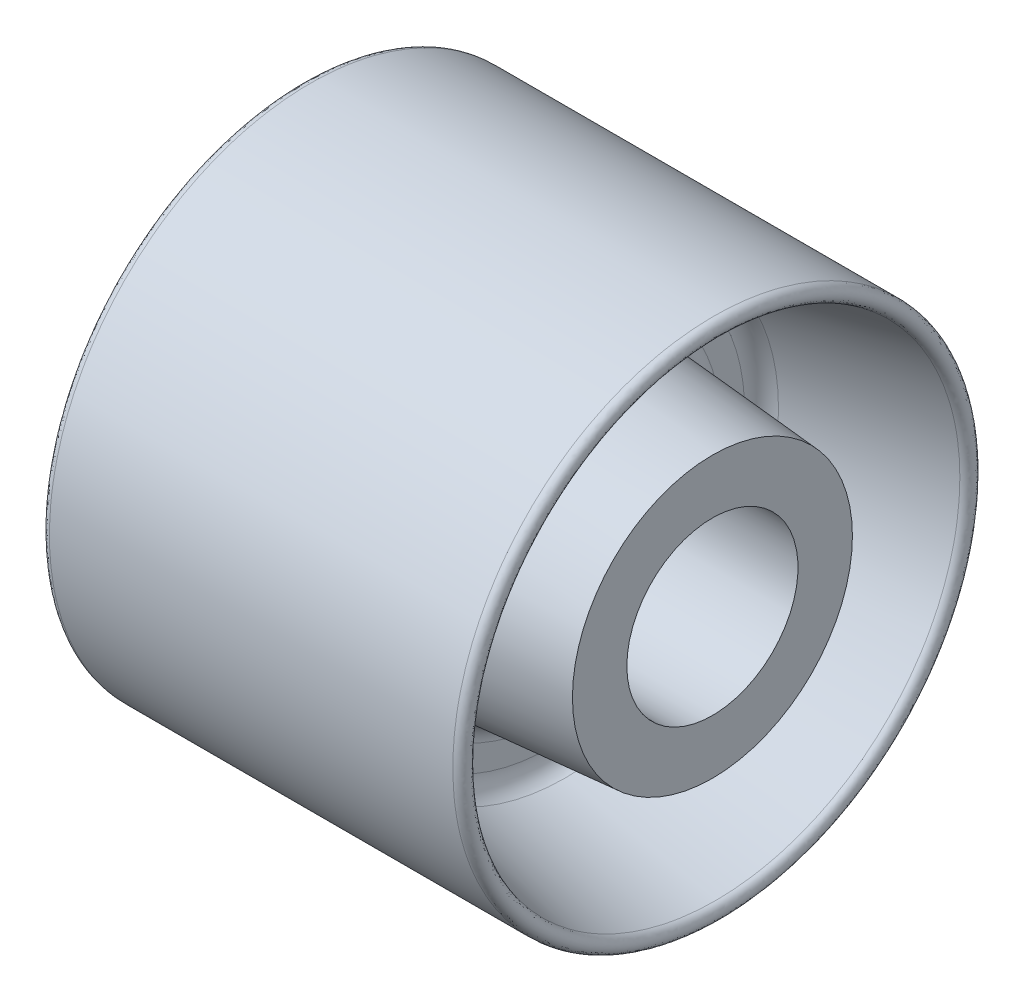
ISO-10303-21;
HEADER;
FILE_DESCRIPTION(('STEP AP214'),'2;1');
FILE_NAME('part.step','',(''),(''),'','','');
FILE_SCHEMA(('AUTOMOTIVE_DESIGN { 1 0 10303 214 1 1 1 1 }'));
ENDSEC;
DATA;
#1=APPLICATION_CONTEXT('core data for automotive mechanical design processes');
#2=APPLICATION_PROTOCOL_DEFINITION('international standard','automotive_design',2000,#1);
#3=PRODUCT_CONTEXT('',#1,'mechanical');
#4=PRODUCT('Part','Part','',(#3));
#5=PRODUCT_RELATED_PRODUCT_CATEGORY('part','',(#4));
#6=PRODUCT_DEFINITION_FORMATION('','',#4);
#7=PRODUCT_DEFINITION_CONTEXT('part definition',#1,'design');
#8=PRODUCT_DEFINITION('design','',#6,#7);
#9=PRODUCT_DEFINITION_SHAPE('','',#8);
#10=(LENGTH_UNIT() NAMED_UNIT(*) SI_UNIT(.MILLI.,.METRE.));
#11=(NAMED_UNIT(*) PLANE_ANGLE_UNIT() SI_UNIT($,.RADIAN.));
#12=(NAMED_UNIT(*) SI_UNIT($,.STERADIAN.) SOLID_ANGLE_UNIT());
#13=UNCERTAINTY_MEASURE_WITH_UNIT(LENGTH_MEASURE(1.E-05),#10,'distance_accuracy_value','');
#14=(GEOMETRIC_REPRESENTATION_CONTEXT(3) GLOBAL_UNCERTAINTY_ASSIGNED_CONTEXT((#13)) GLOBAL_UNIT_ASSIGNED_CONTEXT((#10,
#11,#12)) REPRESENTATION_CONTEXT('',''));
#15=CARTESIAN_POINT('',(0.,0.,0.));
#16=DIRECTION('',(0.,0.,1.));
#17=DIRECTION('',(1.,0.,0.));
#18=AXIS2_PLACEMENT_3D('',#15,#16,#17);
#19=CARTESIAN_POINT('',(31.6980645324234,-2.21631317579351E-12,-41.));
#20=CARTESIAN_POINT('',(31.6980645324234,-5.36688731821035,-40.9999999999997));
#21=CARTESIAN_POINT('',(31.6980645323489,-10.7316633803912,-39.9328796930077));
#22=CARTESIAN_POINT('',(31.6980645324979,-20.6483780735503,-35.8252419729161));
#23=CARTESIAN_POINT('',(31.6980645324234,-25.1964156120478,-32.7863404452495));
#24=CARTESIAN_POINT('',(31.6980645324234,-32.7863404452522,-25.1964156120443));
#25=CARTESIAN_POINT('',(31.6980645324234,-35.8252419728991,-20.6483780735927));
#26=CARTESIAN_POINT('',(31.6980645324234,-39.9328796930281,-10.7316633803406));
#27=CARTESIAN_POINT('',(31.6980645324234,-41.0000000000003,-5.3668873182443));
#28=CARTESIAN_POINT('',(31.6980645324234,-40.9999999999997,5.36688731824873));
#29=CARTESIAN_POINT('',(31.6980645324234,-39.9328796930269,10.7316633803449));
#30=CARTESIAN_POINT('',(31.6980645324234,-35.8252419728969,20.6483780735966));
#31=CARTESIAN_POINT('',(31.6980645324234,-32.7863404452448,25.1964156120525));
#32=CARTESIAN_POINT('',(31.6980645324234,-25.1964156120489,32.7863404452475));
#33=CARTESIAN_POINT('',(31.6980645323489,-20.6483780735927,35.8252419728991));
#34=CARTESIAN_POINT('',(31.6980645324979,-10.7316633803406,39.9328796930281));
#35=CARTESIAN_POINT('',(31.6980645324234,-5.36688731823902,41.0000000000003));
#36=CARTESIAN_POINT('',(31.6980645324234,5.36688731824348,40.9999999999997));
#37=CARTESIAN_POINT('',(31.6980645324234,10.7316633803529,39.9328796930236));
#38=CARTESIAN_POINT('',(31.6980645324234,20.6483780735886,35.8252419729002));
#39=CARTESIAN_POINT('',(31.6980645324234,25.1964156120758,32.7863404452215));
#40=CARTESIAN_POINT('',(31.6980645324234,32.7863404452243,25.1964156120722));
#41=CARTESIAN_POINT('',(31.6980645324234,35.8252419728991,20.6483780735927));
#42=CARTESIAN_POINT('',(31.6980645324234,39.9328796930281,10.7316633803406));
#43=CARTESIAN_POINT('',(31.6980645324234,41.0000000000003,5.36688731824428));
#44=CARTESIAN_POINT('',(31.6980645324234,40.9999999999997,-5.36688731824874));
#45=CARTESIAN_POINT('',(31.6980645324234,39.9328796930236,-10.7316633803528));
#46=CARTESIAN_POINT('',(31.6980645324234,35.8252419729002,-20.6483780735886));
#47=CARTESIAN_POINT('',(31.6980645324234,32.7863404452309,-25.1964156120664));
#48=CARTESIAN_POINT('',(31.6980645324234,25.1964156120629,-32.7863404452336));
#49=CARTESIAN_POINT('',(31.6980645324234,20.6483780735464,-35.8252419729183));
#50=CARTESIAN_POINT('',(31.6980645324234,10.7316633803869,-39.9328796930089));
#51=CARTESIAN_POINT('',(31.6980645324234,5.36688731820592,-41.0000000000003));
#52=CARTESIAN_POINT('',(31.6980645324234,-2.21631317579351E-12,-41.));
#53=CARTESIAN_POINT('',(33.8465040906431,-2.21631317579351E-12,-41.));
#54=CARTESIAN_POINT('',(33.8465040906431,-5.36688731821077,-41.));
#55=CARTESIAN_POINT('',(33.8465040907176,-10.7316633804372,-39.9328796931181));
#56=CARTESIAN_POINT('',(33.8465040905686,-20.6483780735043,-35.8252419728058));
#57=CARTESIAN_POINT('',(33.8465040906245,-25.196415612057,-32.7863404452493));
#58=CARTESIAN_POINT('',(33.8465040906617,-32.7863404452431,-25.1964156120445));
#59=CARTESIAN_POINT('',(33.8465040906617,-35.8252419729006,-20.6483780735933));
#60=CARTESIAN_POINT('',(33.8465040906245,-39.9328796930267,-10.73166338034));
#61=CARTESIAN_POINT('',(33.8465040906617,-41.,-5.36688731824472));
#62=CARTESIAN_POINT('',(33.8465040906245,-41.,5.36688731824914));
#63=CARTESIAN_POINT('',(33.8465040906245,-39.932879693025,10.7316633803441));
#64=CARTESIAN_POINT('',(33.8465040906617,-35.8252419728989,20.6483780735974));
#65=CARTESIAN_POINT('',(33.8465040906431,-32.7863404452586,25.196415612057));
#66=CARTESIAN_POINT('',(33.8465040906431,-25.1964156120352,32.7863404452431));
#67=CARTESIAN_POINT('',(33.8465040907176,-20.6483780736399,35.8252419730123));
#68=CARTESIAN_POINT('',(33.8465040905686,-10.7316633802935,39.932879692915));
#69=CARTESIAN_POINT('',(33.8465040906431,-5.36688731823944,41.));
#70=CARTESIAN_POINT('',(33.8465040906431,5.3668873182439,41.));
#71=CARTESIAN_POINT('',(33.8465040906059,10.7316633803534,39.932879693025));
#72=CARTESIAN_POINT('',(33.8465040906804,20.6483780735881,35.8252419728989));
#73=CARTESIAN_POINT('',(33.8465040906245,25.1964156120849,32.7863404452121));
#74=CARTESIAN_POINT('',(33.8465040906617,32.7863404452152,25.1964156120818));
#75=CARTESIAN_POINT('',(33.8465040906617,35.8252419729006,20.6483780735933));
#76=CARTESIAN_POINT('',(33.8465040906245,39.9328796930267,10.73166338034));
#77=CARTESIAN_POINT('',(33.8465040906431,41.,5.3668873182447));
#78=CARTESIAN_POINT('',(33.8465040906431,41.,-5.36688731824916));
#79=CARTESIAN_POINT('',(33.8465040906245,39.932879693025,-10.7316633803534));
#80=CARTESIAN_POINT('',(33.8465040906617,35.8252419728989,-20.6483780735881));
#81=CARTESIAN_POINT('',(33.8465040906431,32.78634044524,-25.1964156120663));
#82=CARTESIAN_POINT('',(33.8465040906431,25.1964156120538,-32.7863404452338));
#83=CARTESIAN_POINT('',(33.8465040906804,20.6483780735467,-35.8252419729192));
#84=CARTESIAN_POINT('',(33.8465040906059,10.7316633803865,-39.9328796930081));
#85=CARTESIAN_POINT('',(33.8465040906431,5.36688731820634,-41.));
#86=CARTESIAN_POINT('',(33.8465040906431,-2.21631317579351E-12,-41.));
#87=CARTESIAN_POINT('',(34.0673246299096,-2.11317966753846E-12,-38.86293874099));
#88=CARTESIAN_POINT('',(34.0673246299096,-5.08360752716832,-38.86293874099));
#89=CARTESIAN_POINT('',(34.0673246300399,-10.1755618435465,-37.8500860532935));
#90=CARTESIAN_POINT('',(34.0673246297792,-19.56884373485,-33.9592612987861));
#91=CARTESIAN_POINT('',(34.0673246298909,-23.8855941652727,-31.0749008759753));
#92=CARTESIAN_POINT('',(34.0673246299282,-31.0749008759131,-23.8855941652046));
#93=CARTESIAN_POINT('',(34.0673246299282,-33.9592612987133,-19.5688437348647));
#94=CARTESIAN_POINT('',(34.0673246298909,-37.8500860533696,-10.175561843524));
#95=CARTESIAN_POINT('',(34.0673246299096,-38.86293874099,-5.08360752716858));
#96=CARTESIAN_POINT('',(34.0673246299096,-38.86293874099,5.08360752717281));
#97=CARTESIAN_POINT('',(34.0673246298909,-37.850086053368,10.1755618435325));
#98=CARTESIAN_POINT('',(34.0673246299282,-33.9592612987116,19.568843734864));
#99=CARTESIAN_POINT('',(34.0673246299096,-31.0749008759567,23.8855941652541));
#100=CARTESIAN_POINT('',(34.0673246299096,-23.8855941652232,31.0749008759317));
#101=CARTESIAN_POINT('',(34.0673246300399,-19.5688437348554,33.9592612987133));
#102=CARTESIAN_POINT('',(34.0673246297792,-10.1755618435333,37.8500860533696));
#103=CARTESIAN_POINT('',(34.0673246299095,-5.08360752716436,38.86293874099));
#104=CARTESIAN_POINT('',(34.0673246299095,5.08360752716859,38.86293874099));
#105=CARTESIAN_POINT('',(34.0673246298909,10.1755618435512,37.850086053368));
#106=CARTESIAN_POINT('',(34.0673246299282,19.5688437348453,33.9592612987117));
#107=CARTESIAN_POINT('',(34.0673246299095,23.8855941653007,31.0749008759195));
#108=CARTESIAN_POINT('',(34.0673246299095,31.0749008758852,23.8855941652604));
#109=CARTESIAN_POINT('',(34.0673246299282,33.9592612987319,19.5688437348647));
#110=CARTESIAN_POINT('',(34.0673246298909,37.850086053351,10.175561843524));
#111=CARTESIAN_POINT('',(34.0673246299095,38.86293874099,5.08360752716859));
#112=CARTESIAN_POINT('',(34.0673246299095,38.86293874099,-5.08360752717281));
#113=CARTESIAN_POINT('',(34.0673246299095,37.8500860533494,-10.1755618435139));
#114=CARTESIAN_POINT('',(34.0673246299095,33.9592612987303,-19.5688437348825));
#115=CARTESIAN_POINT('',(34.0673246299096,31.0749008759381,-23.8855941652541));
#116=CARTESIAN_POINT('',(34.0673246299096,23.8855941652418,-31.0749008759317));
#117=CARTESIAN_POINT('',(34.0673246299095,19.5688437348368,-33.9592612987319));
#118=CARTESIAN_POINT('',(34.0673246299095,10.1755618435519,-37.850086053351));
#119=CARTESIAN_POINT('',(34.0673246299096,5.08360752716409,-38.86293874099));
#120=CARTESIAN_POINT('',(34.0673246299096,-2.11317966753846E-12,-38.86293874099));
#121=CARTESIAN_POINT('',(31.9642777478536,-2.09116081309969E-12,-38.4236366271796));
#122=CARTESIAN_POINT('',(31.9642777478537,-5.02537549919789,-38.4236366271793));
#123=CARTESIAN_POINT('',(31.9642777478176,-10.0612475815541,-37.4219393894472));
#124=CARTESIAN_POINT('',(31.9642777478897,-19.3469307153259,-33.5756834995556));
#125=CARTESIAN_POINT('',(31.9642777478714,-23.6161369234429,-30.7230911104158));
#126=CARTESIAN_POINT('',(31.9642777478359,-30.7230911104131,-23.6161369234343));
#127=CARTESIAN_POINT('',(31.9642777478334,-33.5756834995408,-19.3469307153323));
#128=CARTESIAN_POINT('',(31.9642777478739,-37.4219393894652,-10.06124758154));
#129=CARTESIAN_POINT('',(31.9642777478536,-38.4236366271798,-5.02537549918906));
#130=CARTESIAN_POINT('',(31.9642777478537,-38.4236366271793,5.02537549919324));
#131=CARTESIAN_POINT('',(31.9642777478742,-37.4219393894625,10.0612475815481));
#132=CARTESIAN_POINT('',(31.9642777478331,-33.5756834995403,19.3469307153319));
#133=CARTESIAN_POINT('',(31.9642777478701,-30.7230911104109,23.6161369234473));
#134=CARTESIAN_POINT('',(31.9642777478372,-23.6161369234391,30.7230911104086));
#135=CARTESIAN_POINT('',(31.9642777478152,-19.3469307153268,33.5756834995389));
#136=CARTESIAN_POINT('',(31.9642777478921,-10.0612475815455,37.4219393894671));
#137=CARTESIAN_POINT('',(31.9642777478536,-5.02537549918906,38.4236366271798));
#138=CARTESIAN_POINT('',(31.9642777478537,5.02537549919324,38.4236366271793));
#139=CARTESIAN_POINT('',(31.9642777478889,10.0612475815598,37.421939389461));
#140=CARTESIAN_POINT('',(31.9642777478184,19.3469307153202,33.5756834995418));
#141=CARTESIAN_POINT('',(31.9642777478714,23.6161369234801,30.7230911103785));
#142=CARTESIAN_POINT('',(31.9642777478359,30.7230911103758,23.6161369234715));
#143=CARTESIAN_POINT('',(31.9642777478368,33.5756834995442,19.3469307153259));
#144=CARTESIAN_POINT('',(31.9642777478705,37.4219393894618,10.0612475815463));
#145=CARTESIAN_POINT('',(31.9642777478536,38.4236366271798,5.02537549918907));
#146=CARTESIAN_POINT('',(31.9642777478537,38.4236366271793,-5.02537549919323));
#147=CARTESIAN_POINT('',(31.9642777478693,37.4219393894655,-10.0612475815384));
#148=CARTESIAN_POINT('',(31.964277747838,33.5756834995374,-19.3469307153416));
#149=CARTESIAN_POINT('',(31.9642777478688,30.7230911104061,-23.6161369234518));
#150=CARTESIAN_POINT('',(31.9642777478385,23.616136923444,-30.7230911104041));
#151=CARTESIAN_POINT('',(31.9642777478357,19.3469307153139,-33.5756834995489));
#152=CARTESIAN_POINT('',(31.9642777478716,10.0612475815583,-37.4219393894571));
#153=CARTESIAN_POINT('',(31.9642777478536,5.02537549919371,-38.4236366271798));
#154=CARTESIAN_POINT('',(31.9642777478536,-2.09116081309969E-12,-38.4236366271796));
#155=(BOUNDED_SURFACE() B_SPLINE_SURFACE(3,3,((#19,#20,#21,#22,#23,#24,#25,#26,#27,#28,#29,#30,
#31,#32,#33,#34,#35,#36,#37,#38,#39,#40,#41,#42,#43,#44,#45,#46,#47,#48,#49,#50,#51,#52),(#53,
#54,#55,#56,#57,#58,#59,#60,#61,#62,#63,#64,#65,#66,#67,#68,#69,#70,#71,#72,#73,#74,#75,#76,#77,
#78,#79,#80,#81,#82,#83,#84,#85,#86),(#87,#88,#89,#90,#91,#92,#93,#94,#95,#96,#97,#98,#99,#100,
#101,#102,#103,#104,#105,#106,#107,#108,#109,#110,#111,#112,#113,#114,#115,#116,#117,#118,#119,
#120),(#121,#122,#123,#124,#125,#126,#127,#128,#129,#130,#131,#132,#133,#134,#135,#136,#137,
#138,#139,#140,#141,#142,#143,#144,#145,#146,#147,#148,#149,#150,#151,#152,#153,#154)),
.UNSPECIFIED.,.F.,.T.,.F.) B_SPLINE_SURFACE_WITH_KNOTS((4,4),(4,2,2,2,2,2,2,2,2,2,2,2,2,2,2,2,
4),(0.,1.),(0.500000000000009,0.562500000000009,0.625000000000009,0.687500000000009,
0.750000000000009,0.812500000000009,0.875000000000009,0.937500000000009,1.00000000000001,
1.06250000000001,1.12500000000001,1.18750000000001,1.25000000000001,1.31250000000001,
1.37500000000001,1.43750000000001,1.50000000000001),
.UNSPECIFIED.) GEOMETRIC_REPRESENTATION_ITEM() RATIONAL_B_SPLINE_SURFACE(((1.,1.,1.,1.,1.,1.,1.,
1.,1.,1.,1.,1.,1.,1.,1.,1.,1.,1.,1.,1.,1.,1.,1.,1.,1.,1.,1.,1.,1.,1.,1.,1.,1.,1.),
(0.401854550176989,0.401854550176989,0.401854550176991,0.401854550176991,0.401854550176989,
0.401854550176989,0.401854550176991,0.401854550176991,0.401854550176989,0.401854550176989,
0.401854550176989,0.401854550176989,0.40185455017699,0.40185455017699,0.401854550176991,
0.401854550176991,0.401854550176993,0.401854550176993,0.401854550176993,0.401854550176993,
0.401854550176993,0.401854550176993,0.401854550176993,0.401854550176993,0.401854550176993,
0.401854550176993,0.401854550176991,0.401854550176991,0.401854550176991,0.401854550176991,
0.401854550176991,0.401854550176991,0.401854550176989,0.401854550176989),(0.401854550176989,
0.401854550176989,0.401854550176991,0.401854550176991,0.401854550176989,0.401854550176989,
0.401854550176991,0.401854550176991,0.401854550176989,0.401854550176989,0.401854550176989,
0.401854550176989,0.40185455017699,0.40185455017699,0.401854550176991,0.401854550176991,
0.401854550176993,0.401854550176993,0.401854550176993,0.401854550176993,0.401854550176993,
0.401854550176993,0.401854550176993,0.401854550176993,0.401854550176993,0.401854550176993,
0.401854550176991,0.401854550176991,0.401854550176991,0.401854550176991,0.401854550176991,
0.401854550176991,0.401854550176989,0.401854550176989),(1.,1.,1.,1.,1.,1.,1.,1.,1.,1.,1.,1.,1.,
1.,1.,1.,1.,1.,1.,1.,1.,1.,1.,1.,1.,1.,1.,1.,1.,1.,1.,1.,1.,1.))) REPRESENTATION_ITEM('') SURFACE());
#156=CARTESIAN_POINT('',(31.6980645324234,-2.21631317579351E-12,-41.));
#157=CARTESIAN_POINT('',(31.6980645324234,5.36688731820592,-41.0000000000003));
#158=CARTESIAN_POINT('',(31.6980645324234,10.7316633803869,-39.9328796930089));
#159=CARTESIAN_POINT('',(31.6980645324234,20.6483780735464,-35.8252419729183));
#160=CARTESIAN_POINT('',(31.6980645324234,25.1964156120629,-32.7863404452336));
#161=CARTESIAN_POINT('',(31.6980645324234,32.7863404452309,-25.1964156120664));
#162=CARTESIAN_POINT('',(31.6980645324234,35.8252419729002,-20.6483780735886));
#163=CARTESIAN_POINT('',(31.6980645324234,39.9328796930236,-10.7316633803528));
#164=CARTESIAN_POINT('',(31.6980645324234,40.9999999999997,-5.36688731824874));
#165=CARTESIAN_POINT('',(31.6980645324234,41.0000000000003,5.36688731824428));
#166=CARTESIAN_POINT('',(31.6980645324234,39.9328796930281,10.7316633803406));
#167=CARTESIAN_POINT('',(31.6980645324234,35.8252419728991,20.6483780735927));
#168=CARTESIAN_POINT('',(31.6980645324234,32.7863404452243,25.1964156120722));
#169=CARTESIAN_POINT('',(31.6980645324234,25.1964156120758,32.7863404452215));
#170=CARTESIAN_POINT('',(31.6980645324234,20.6483780735886,35.8252419729002));
#171=CARTESIAN_POINT('',(31.6980645324234,10.7316633803529,39.9328796930236));
#172=CARTESIAN_POINT('',(31.6980645324234,5.36688731824348,40.9999999999997));
#173=CARTESIAN_POINT('',(31.6980645324234,-5.36688731823902,41.0000000000003));
#174=CARTESIAN_POINT('',(31.6980645324979,-10.7316633803406,39.9328796930281));
#175=CARTESIAN_POINT('',(31.6980645323489,-20.6483780735927,35.8252419728991));
#176=CARTESIAN_POINT('',(31.6980645324234,-25.1964156120489,32.7863404452475));
#177=CARTESIAN_POINT('',(31.6980645324234,-32.7863404452448,25.1964156120525));
#178=CARTESIAN_POINT('',(31.6980645324234,-35.8252419728969,20.6483780735966));
#179=CARTESIAN_POINT('',(31.6980645324234,-39.9328796930269,10.7316633803449));
#180=CARTESIAN_POINT('',(31.6980645324234,-40.9999999999997,5.36688731824873));
#181=CARTESIAN_POINT('',(31.6980645324234,-41.0000000000003,-5.3668873182443));
#182=CARTESIAN_POINT('',(31.6980645324234,-39.9328796930281,-10.7316633803406));
#183=CARTESIAN_POINT('',(31.6980645324234,-35.8252419728991,-20.6483780735927));
#184=CARTESIAN_POINT('',(31.6980645324234,-32.7863404452522,-25.1964156120443));
#185=CARTESIAN_POINT('',(31.6980645324234,-25.1964156120478,-32.7863404452495));
#186=CARTESIAN_POINT('',(31.6980645324979,-20.6483780735503,-35.8252419729161));
#187=CARTESIAN_POINT('',(31.6980645323489,-10.7316633803912,-39.9328796930077));
#188=CARTESIAN_POINT('',(31.6980645324234,-5.36688731821035,-40.9999999999997));
#189=CARTESIAN_POINT('',(31.6980645324234,-2.21631317579351E-12,-41.));
#190=(BOUNDED_CURVE() B_SPLINE_CURVE(3,(#156,#157,#158,#159,#160,#161,#162,#163,#164,#165,#166,
#167,#168,#169,#170,#171,#172,#173,#174,#175,#176,#177,#178,#179,#180,#181,#182,#183,#184,#185,
#186,#187,#188,#189),.UNSPECIFIED.,.T.,.F.) B_SPLINE_CURVE_WITH_KNOTS((4,2,2,2,2,2,2,2,2,2,2,2,
2,2,2,2,4),(0.500000000000009,0.562500000000009,0.625000000000009,0.687500000000009,
0.750000000000009,0.812500000000009,0.875000000000009,0.937500000000009,1.00000000000001,
1.06250000000001,1.12500000000001,1.18750000000001,1.25000000000001,1.31250000000001,
1.37500000000001,1.43750000000001,1.50000000000001),
.UNSPECIFIED.) CURVE() GEOMETRIC_REPRESENTATION_ITEM() RATIONAL_B_SPLINE_CURVE((1.,1.,1.,1.,1.,
1.,1.,1.,1.,1.,1.,1.,1.,1.,1.,1.,1.,1.,1.,1.,1.,1.,1.,1.,1.,1.,1.,1.,1.,1.,1.,1.,1.,1.)) REPRESENTATION_ITEM(''));
#191=CARTESIAN_POINT('',(31.6980645324234,-2.21631317579351E-12,-41.));
#192=VERTEX_POINT('',#191);
#193=EDGE_CURVE('E51',#192,#192,#190,.F.);
#194=CARTESIAN_POINT('',(31.9642777478536,-2.09116081309969E-12,-38.4236366271796));
#195=CARTESIAN_POINT('',(31.9642777478537,-5.02537549919789,-38.4236366271793));
#196=CARTESIAN_POINT('',(31.9642777478176,-10.0612475815541,-37.4219393894472));
#197=CARTESIAN_POINT('',(31.9642777478897,-19.3469307153259,-33.5756834995556));
#198=CARTESIAN_POINT('',(31.9642777478714,-23.6161369234429,-30.7230911104158));
#199=CARTESIAN_POINT('',(31.9642777478359,-30.7230911104131,-23.6161369234343));
#200=CARTESIAN_POINT('',(31.9642777478334,-33.5756834995408,-19.3469307153323));
#201=CARTESIAN_POINT('',(31.9642777478739,-37.4219393894652,-10.06124758154));
#202=CARTESIAN_POINT('',(31.9642777478536,-38.4236366271798,-5.02537549918906));
#203=CARTESIAN_POINT('',(31.9642777478537,-38.4236366271793,5.02537549919324));
#204=CARTESIAN_POINT('',(31.9642777478742,-37.4219393894625,10.0612475815481));
#205=CARTESIAN_POINT('',(31.9642777478331,-33.5756834995403,19.3469307153319));
#206=CARTESIAN_POINT('',(31.9642777478701,-30.7230911104109,23.6161369234473));
#207=CARTESIAN_POINT('',(31.9642777478372,-23.6161369234391,30.7230911104086));
#208=CARTESIAN_POINT('',(31.9642777478152,-19.3469307153268,33.5756834995389));
#209=CARTESIAN_POINT('',(31.9642777478921,-10.0612475815455,37.4219393894671));
#210=CARTESIAN_POINT('',(31.9642777478536,-5.02537549918906,38.4236366271798));
#211=CARTESIAN_POINT('',(31.9642777478537,5.02537549919324,38.4236366271793));
#212=CARTESIAN_POINT('',(31.9642777478889,10.0612475815598,37.421939389461));
#213=CARTESIAN_POINT('',(31.9642777478184,19.3469307153202,33.5756834995418));
#214=CARTESIAN_POINT('',(31.9642777478714,23.6161369234801,30.7230911103785));
#215=CARTESIAN_POINT('',(31.9642777478359,30.7230911103758,23.6161369234715));
#216=CARTESIAN_POINT('',(31.9642777478368,33.5756834995442,19.3469307153259));
#217=CARTESIAN_POINT('',(31.9642777478705,37.4219393894618,10.0612475815463));
#218=CARTESIAN_POINT('',(31.9642777478536,38.4236366271798,5.02537549918907));
#219=CARTESIAN_POINT('',(31.9642777478537,38.4236366271793,-5.02537549919323));
#220=CARTESIAN_POINT('',(31.9642777478693,37.4219393894655,-10.0612475815384));
#221=CARTESIAN_POINT('',(31.964277747838,33.5756834995374,-19.3469307153416));
#222=CARTESIAN_POINT('',(31.9642777478688,30.7230911104061,-23.6161369234518));
#223=CARTESIAN_POINT('',(31.9642777478385,23.616136923444,-30.7230911104041));
#224=CARTESIAN_POINT('',(31.9642777478357,19.3469307153139,-33.5756834995489));
#225=CARTESIAN_POINT('',(31.9642777478716,10.0612475815583,-37.4219393894571));
#226=CARTESIAN_POINT('',(31.9642777478536,5.02537549919371,-38.4236366271798));
#227=CARTESIAN_POINT('',(31.9642777478536,-2.09116081309969E-12,-38.4236366271796));
#228=(BOUNDED_CURVE() B_SPLINE_CURVE(3,(#194,#195,#196,#197,#198,#199,#200,#201,#202,#203,#204,
#205,#206,#207,#208,#209,#210,#211,#212,#213,#214,#215,#216,#217,#218,#219,#220,#221,#222,#223,
#224,#225,#226,#227),.UNSPECIFIED.,.T.,.F.) B_SPLINE_CURVE_WITH_KNOTS((4,2,2,2,2,2,2,2,2,2,2,2,
2,2,2,2,4),(0.500000000000009,0.562500000000009,0.625000000000009,0.687500000000009,
0.750000000000009,0.812500000000009,0.875000000000009,0.937500000000009,1.00000000000001,
1.06250000000001,1.12500000000001,1.18750000000001,1.25000000000001,1.31250000000001,
1.37500000000001,1.43750000000001,1.50000000000001),
.UNSPECIFIED.) CURVE() GEOMETRIC_REPRESENTATION_ITEM() RATIONAL_B_SPLINE_CURVE((1.,1.,1.,1.,1.,
1.,1.,1.,1.,1.,1.,1.,1.,1.,1.,1.,1.,1.,1.,1.,1.,1.,1.,1.,1.,1.,1.,1.,1.,1.,1.,1.,1.,1.)) REPRESENTATION_ITEM(''));
#229=CARTESIAN_POINT('',(31.9642777478536,-2.09116081309969E-12,-38.4236366271796));
#230=VERTEX_POINT('',#229);
#231=EDGE_CURVE('E10',#230,#230,#228,.F.);
#232=ORIENTED_EDGE('',*,*,#193,.F.);
#233=EDGE_LOOP('',(#232));
#234=FACE_BOUND('',#233,.T.);
#235=ORIENTED_EDGE('',*,*,#231,.F.);
#236=EDGE_LOOP('',(#235));
#237=FACE_BOUND('',#236,.T.);
#238=ADVANCED_FACE('F38',(#234,#237),#155,.T.);
#239=CARTESIAN_POINT('',(-113.627257408462,0.,0.));
#240=DIRECTION('',(-1.,0.,0.));
#241=DIRECTION('',(0.,0.,1.));
#242=AXIS2_PLACEMENT_3D('',#239,#240,#241);
#243=CYLINDRICAL_SURFACE('',#242,13.45);
#244=CARTESIAN_POINT('',(31.5,0.,0.));
#245=DIRECTION('',(-1.,0.,0.));
#246=DIRECTION('',(0.,0.,1.));
#247=AXIS2_PLACEMENT_3D('',#244,#245,#246);
#248=CIRCLE('',#247,13.45);
#249=CARTESIAN_POINT('',(31.5,0.,13.45));
#250=VERTEX_POINT('',#249);
#251=EDGE_CURVE('E132',#250,#250,#248,.T.);
#252=ORIENTED_EDGE('',*,*,#251,.F.);
#253=EDGE_LOOP('',(#252));
#254=FACE_BOUND('',#253,.T.);
#255=CARTESIAN_POINT('',(-31.5,0.,0.));
#256=DIRECTION('',(-1.,0.,0.));
#257=DIRECTION('',(0.,0.,1.));
#258=AXIS2_PLACEMENT_3D('',#255,#256,#257);
#259=CIRCLE('',#258,13.45);
#260=CARTESIAN_POINT('',(-31.5,0.,13.45));
#261=VERTEX_POINT('',#260);
#262=EDGE_CURVE('E226',#261,#261,#259,.T.);
#263=ORIENTED_EDGE('',*,*,#262,.T.);
#264=EDGE_LOOP('',(#263));
#265=FACE_BOUND('',#264,.T.);
#266=ADVANCED_FACE('F84',(#254,#265),#243,.F.);
#267=CARTESIAN_POINT('',(-113.627257408462,0.,0.));
#268=DIRECTION('',(-1.,0.,0.));
#269=DIRECTION('',(0.,0.,1.));
#270=AXIS2_PLACEMENT_3D('',#267,#268,#269);
#271=CYLINDRICAL_SURFACE('',#270,41.);
#272=ORIENTED_EDGE('',*,*,#193,.T.);
#273=EDGE_LOOP('',(#272));
#274=FACE_BOUND('',#273,.T.);
#275=CARTESIAN_POINT('',(-31.6980645324234,-2.21631317579351E-12,-41.));
#276=CARTESIAN_POINT('',(-31.6980645324234,-5.36688731821035,-40.9999999999997));
#277=CARTESIAN_POINT('',(-31.6980645323489,-10.7316633803912,-39.9328796930077));
#278=CARTESIAN_POINT('',(-31.6980645324979,-20.6483780735503,-35.8252419729161));
#279=CARTESIAN_POINT('',(-31.6980645324234,-25.1964156120478,-32.7863404452495));
#280=CARTESIAN_POINT('',(-31.6980645324234,-32.7863404452522,-25.1964156120443));
#281=CARTESIAN_POINT('',(-31.6980645324234,-35.8252419728991,-20.6483780735927));
#282=CARTESIAN_POINT('',(-31.6980645324234,-39.9328796930281,-10.7316633803406));
#283=CARTESIAN_POINT('',(-31.6980645324234,-41.0000000000003,-5.3668873182443));
#284=CARTESIAN_POINT('',(-31.6980645324234,-40.9999999999997,5.36688731824873));
#285=CARTESIAN_POINT('',(-31.6980645324234,-39.9328796930269,10.7316633803449));
#286=CARTESIAN_POINT('',(-31.6980645324234,-35.8252419728969,20.6483780735966));
#287=CARTESIAN_POINT('',(-31.6980645324234,-32.7863404452448,25.1964156120525));
#288=CARTESIAN_POINT('',(-31.6980645324234,-25.1964156120489,32.7863404452475));
#289=CARTESIAN_POINT('',(-31.6980645323489,-20.6483780735927,35.8252419728991));
#290=CARTESIAN_POINT('',(-31.6980645324979,-10.7316633803406,39.9328796930281));
#291=CARTESIAN_POINT('',(-31.6980645324234,-5.36688731823902,41.0000000000003));
#292=CARTESIAN_POINT('',(-31.6980645324234,5.36688731824348,40.9999999999997));
#293=CARTESIAN_POINT('',(-31.6980645324234,10.7316633803529,39.9328796930236));
#294=CARTESIAN_POINT('',(-31.6980645324234,20.6483780735886,35.8252419729002));
#295=CARTESIAN_POINT('',(-31.6980645324234,25.1964156120758,32.7863404452215));
#296=CARTESIAN_POINT('',(-31.6980645324234,32.7863404452243,25.1964156120722));
#297=CARTESIAN_POINT('',(-31.6980645324234,35.8252419728991,20.6483780735927));
#298=CARTESIAN_POINT('',(-31.6980645324234,39.9328796930281,10.7316633803406));
#299=CARTESIAN_POINT('',(-31.6980645324234,41.0000000000003,5.36688731824428));
#300=CARTESIAN_POINT('',(-31.6980645324234,40.9999999999997,-5.36688731824874));
#301=CARTESIAN_POINT('',(-31.6980645324234,39.9328796930236,-10.7316633803528));
#302=CARTESIAN_POINT('',(-31.6980645324234,35.8252419729002,-20.6483780735886));
#303=CARTESIAN_POINT('',(-31.6980645324234,32.7863404452309,-25.1964156120664));
#304=CARTESIAN_POINT('',(-31.6980645324234,25.1964156120629,-32.7863404452336));
#305=CARTESIAN_POINT('',(-31.6980645324234,20.6483780735464,-35.8252419729183));
#306=CARTESIAN_POINT('',(-31.6980645324234,10.7316633803869,-39.9328796930089));
#307=CARTESIAN_POINT('',(-31.6980645324234,5.36688731820592,-41.0000000000003));
#308=CARTESIAN_POINT('',(-31.6980645324234,-2.21631317579351E-12,-41.));
#309=(BOUNDED_CURVE() B_SPLINE_CURVE(3,(#275,#276,#277,#278,#279,#280,#281,#282,#283,#284,#285,
#286,#287,#288,#289,#290,#291,#292,#293,#294,#295,#296,#297,#298,#299,#300,#301,#302,#303,#304,
#305,#306,#307,#308),.UNSPECIFIED.,.T.,.F.) B_SPLINE_CURVE_WITH_KNOTS((4,2,2,2,2,2,2,2,2,2,2,2,
2,2,2,2,4),(0.500000000000009,0.562500000000009,0.625000000000009,0.687500000000009,
0.750000000000009,0.812500000000009,0.875000000000009,0.937500000000009,1.00000000000001,
1.06250000000001,1.12500000000001,1.18750000000001,1.25000000000001,1.31250000000001,
1.37500000000001,1.43750000000001,1.50000000000001),
.UNSPECIFIED.) CURVE() GEOMETRIC_REPRESENTATION_ITEM() RATIONAL_B_SPLINE_CURVE((1.,1.,1.,1.,1.,
1.,1.,1.,1.,1.,1.,1.,1.,1.,1.,1.,1.,1.,1.,1.,1.,1.,1.,1.,1.,1.,1.,1.,1.,1.,1.,1.,1.,1.)) REPRESENTATION_ITEM(''));
#310=CARTESIAN_POINT('',(-31.6980645324234,-2.21631317579351E-12,-41.));
#311=VERTEX_POINT('',#310);
#312=EDGE_CURVE('E127',#311,#311,#309,.T.);
#313=ORIENTED_EDGE('',*,*,#312,.F.);
#314=EDGE_LOOP('',(#313));
#315=FACE_BOUND('',#314,.T.);
#316=ADVANCED_FACE('F73',(#274,#315),#271,.T.);
#317=CARTESIAN_POINT('',(6.00000000000001,0.,0.));
#318=DIRECTION('',(1.,0.,0.));
#319=DIRECTION('',(0.,0.,-1.));
#320=AXIS2_PLACEMENT_3D('',#317,#318,#319);
#321=CONICAL_SURFACE('',#320,33.,0.205927314617703);
#322=ORIENTED_EDGE('',*,*,#231,.T.);
#323=EDGE_LOOP('',(#322));
#324=FACE_BOUND('',#323,.T.);
#325=CARTESIAN_POINT('',(8.38657509056319,0.,0.));
#326=DIRECTION('',(1.,0.,0.));
#327=DIRECTION('',(0.,0.,-1.));
#328=AXIS2_PLACEMENT_3D('',#325,#326,#327);
#329=CIRCLE('',#328,33.4985278697291);
#330=CARTESIAN_POINT('',(8.38657509056319,0.,-33.4985278697291));
#331=VERTEX_POINT('',#330);
#332=EDGE_CURVE('E196',#331,#331,#329,.F.);
#333=ORIENTED_EDGE('',*,*,#332,.T.);
#334=EDGE_LOOP('',(#333));
#335=FACE_BOUND('',#334,.T.);
#336=ADVANCED_FACE('F83',(#324,#335),#321,.F.);
#337=CARTESIAN_POINT('',(6.00000000000001,33.,0.));
#338=DIRECTION('',(-1.,0.,0.));
#339=DIRECTION('',(0.,0.,1.));
#340=AXIS2_PLACEMENT_3D('',#337,#338,#339);
#341=PLANE('',#340);
#342=CARTESIAN_POINT('',(6.00000000000001,0.,0.));
#343=DIRECTION('',(-1.,0.,0.));
#344=DIRECTION('',(0.,0.,1.));
#345=AXIS2_PLACEMENT_3D('',#342,#343,#344);
#346=CIRCLE('',#345,26.7739189558656);
#347=CARTESIAN_POINT('',(6.00000000000001,0.,26.7739189558656));
#348=VERTEX_POINT('',#347);
#349=EDGE_CURVE('E61',#348,#348,#346,.T.);
#350=ORIENTED_EDGE('',*,*,#349,.T.);
#351=EDGE_LOOP('',(#350));
#352=FACE_BOUND('',#351,.T.);
#353=CARTESIAN_POINT('',(6.00000000000001,0.,0.));
#354=DIRECTION('',(-1.,0.,0.));
#355=DIRECTION('',(0.,0.,1.));
#356=AXIS2_PLACEMENT_3D('',#353,#354,#355);
#357=CIRCLE('',#356,30.5619124913586);
#358=CARTESIAN_POINT('',(6.00000000000001,0.,30.5619124913586));
#359=VERTEX_POINT('',#358);
#360=EDGE_CURVE('E66',#359,#359,#357,.F.);
#361=ORIENTED_EDGE('',*,*,#360,.T.);
#362=EDGE_LOOP('',(#361));
#363=FACE_BOUND('',#362,.T.);
#364=ADVANCED_FACE('F201',(#352,#363),#341,.F.);
#365=CARTESIAN_POINT('',(31.5,0.,0.));
#366=DIRECTION('',(-1.,0.,0.));
#367=DIRECTION('',(0.,0.,1.));
#368=AXIS2_PLACEMENT_3D('',#365,#366,#367);
#369=CONICAL_SURFACE('',#368,22.,0.078271140521278);
#370=CARTESIAN_POINT('',(8.76542626404411,0.,0.));
#371=DIRECTION('',(-1.,0.,0.));
#372=DIRECTION('',(0.,0.,1.));
#373=AXIS2_PLACEMENT_3D('',#370,#371,#372);
#374=CIRCLE('',#373,23.7831038224279);
#375=CARTESIAN_POINT('',(8.76542626404411,0.,23.7831038224279));
#376=VERTEX_POINT('',#375);
#377=EDGE_CURVE('E56',#376,#376,#374,.F.);
#378=ORIENTED_EDGE('',*,*,#377,.T.);
#379=EDGE_LOOP('',(#378));
#380=FACE_BOUND('',#379,.T.);
#381=CARTESIAN_POINT('',(31.5,0.,0.));
#382=DIRECTION('',(-1.,0.,0.));
#383=DIRECTION('',(0.,0.,1.));
#384=AXIS2_PLACEMENT_3D('',#381,#382,#383);
#385=CIRCLE('',#384,22.);
#386=CARTESIAN_POINT('',(31.5,0.,22.));
#387=VERTEX_POINT('',#386);
#388=EDGE_CURVE('E193',#387,#387,#385,.T.);
#389=ORIENTED_EDGE('',*,*,#388,.T.);
#390=EDGE_LOOP('',(#389));
#391=FACE_BOUND('',#390,.T.);
#392=ADVANCED_FACE('F209',(#380,#391),#369,.T.);
#393=CARTESIAN_POINT('',(31.5,22.,0.));
#394=DIRECTION('',(-1.,0.,0.));
#395=DIRECTION('',(0.,0.,1.));
#396=AXIS2_PLACEMENT_3D('',#393,#394,#395);
#397=PLANE('',#396);
#398=ORIENTED_EDGE('',*,*,#388,.F.);
#399=EDGE_LOOP('',(#398));
#400=FACE_BOUND('',#399,.T.);
#401=ORIENTED_EDGE('',*,*,#251,.T.);
#402=EDGE_LOOP('',(#401));
#403=FACE_BOUND('',#402,.T.);
#404=ADVANCED_FACE('F94',(#400,#403),#397,.F.);
#405=CARTESIAN_POINT('',(9.00000000000001,0.,0.));
#406=DIRECTION('',(-1.,0.,0.));
#407=DIRECTION('',(0.,0.,1.));
#408=AXIS2_PLACEMENT_3D('',#405,#406,#407);
#409=TOROIDAL_SURFACE('',#408,30.5619124913586,3.);
#410=ORIENTED_EDGE('',*,*,#360,.F.);
#411=EDGE_LOOP('',(#410));
#412=FACE_BOUND('',#411,.T.);
#413=ORIENTED_EDGE('',*,*,#332,.F.);
#414=EDGE_LOOP('',(#413));
#415=FACE_BOUND('',#414,.T.);
#416=ADVANCED_FACE('F91',(#412,#415),#409,.F.);
#417=CARTESIAN_POINT('',(9.00000000000001,0.,0.));
#418=DIRECTION('',(-1.,0.,0.));
#419=DIRECTION('',(0.,0.,1.));
#420=AXIS2_PLACEMENT_3D('',#417,#418,#419);
#421=TOROIDAL_SURFACE('',#420,26.7739189558656,3.);
#422=ORIENTED_EDGE('',*,*,#377,.F.);
#423=EDGE_LOOP('',(#422));
#424=FACE_BOUND('',#423,.T.);
#425=ORIENTED_EDGE('',*,*,#349,.F.);
#426=EDGE_LOOP('',(#425));
#427=FACE_BOUND('',#426,.T.);
#428=ADVANCED_FACE('F93',(#424,#427),#421,.F.);
#429=CARTESIAN_POINT('',(-31.6980645324234,-2.21631317579351E-12,-41.));
#430=CARTESIAN_POINT('',(-31.6980645324234,-5.36688731821035,-40.9999999999997));
#431=CARTESIAN_POINT('',(-31.6980645323489,-10.7316633803912,-39.9328796930077));
#432=CARTESIAN_POINT('',(-31.6980645324979,-20.6483780735503,-35.8252419729161));
#433=CARTESIAN_POINT('',(-31.6980645324234,-25.1964156120478,-32.7863404452495));
#434=CARTESIAN_POINT('',(-31.6980645324234,-32.7863404452522,-25.1964156120443));
#435=CARTESIAN_POINT('',(-31.6980645324234,-35.8252419728991,-20.6483780735927));
#436=CARTESIAN_POINT('',(-31.6980645324234,-39.9328796930281,-10.7316633803406));
#437=CARTESIAN_POINT('',(-31.6980645324234,-41.0000000000003,-5.3668873182443));
#438=CARTESIAN_POINT('',(-31.6980645324234,-40.9999999999997,5.36688731824873));
#439=CARTESIAN_POINT('',(-31.6980645324234,-39.9328796930269,10.7316633803449));
#440=CARTESIAN_POINT('',(-31.6980645324234,-35.8252419728969,20.6483780735966));
#441=CARTESIAN_POINT('',(-31.6980645324234,-32.7863404452448,25.1964156120525));
#442=CARTESIAN_POINT('',(-31.6980645324234,-25.1964156120489,32.7863404452475));
#443=CARTESIAN_POINT('',(-31.6980645323489,-20.6483780735927,35.8252419728991));
#444=CARTESIAN_POINT('',(-31.6980645324979,-10.7316633803406,39.9328796930281));
#445=CARTESIAN_POINT('',(-31.6980645324234,-5.36688731823902,41.0000000000003));
#446=CARTESIAN_POINT('',(-31.6980645324234,5.36688731824348,40.9999999999997));
#447=CARTESIAN_POINT('',(-31.6980645324234,10.7316633803529,39.9328796930236));
#448=CARTESIAN_POINT('',(-31.6980645324234,20.6483780735886,35.8252419729002));
#449=CARTESIAN_POINT('',(-31.6980645324234,25.1964156120758,32.7863404452215));
#450=CARTESIAN_POINT('',(-31.6980645324234,32.7863404452243,25.1964156120722));
#451=CARTESIAN_POINT('',(-31.6980645324234,35.8252419728991,20.6483780735927));
#452=CARTESIAN_POINT('',(-31.6980645324234,39.9328796930281,10.7316633803406));
#453=CARTESIAN_POINT('',(-31.6980645324234,41.0000000000003,5.36688731824428));
#454=CARTESIAN_POINT('',(-31.6980645324234,40.9999999999997,-5.36688731824874));
#455=CARTESIAN_POINT('',(-31.6980645324234,39.9328796930236,-10.7316633803528));
#456=CARTESIAN_POINT('',(-31.6980645324234,35.8252419729002,-20.6483780735886));
#457=CARTESIAN_POINT('',(-31.6980645324234,32.7863404452309,-25.1964156120664));
#458=CARTESIAN_POINT('',(-31.6980645324234,25.1964156120629,-32.7863404452336));
#459=CARTESIAN_POINT('',(-31.6980645324234,20.6483780735464,-35.8252419729183));
#460=CARTESIAN_POINT('',(-31.6980645324234,10.7316633803869,-39.9328796930089));
#461=CARTESIAN_POINT('',(-31.6980645324234,5.36688731820592,-41.0000000000003));
#462=CARTESIAN_POINT('',(-31.6980645324234,-2.21631317579351E-12,-41.));
#463=CARTESIAN_POINT('',(-33.8465040906431,-2.21631317579351E-12,-41.));
#464=CARTESIAN_POINT('',(-33.8465040906431,-5.36688731821077,-41.));
#465=CARTESIAN_POINT('',(-33.8465040907176,-10.7316633804372,-39.9328796931181));
#466=CARTESIAN_POINT('',(-33.8465040905686,-20.6483780735043,-35.8252419728058));
#467=CARTESIAN_POINT('',(-33.8465040906245,-25.196415612057,-32.7863404452493));
#468=CARTESIAN_POINT('',(-33.8465040906617,-32.7863404452431,-25.1964156120445));
#469=CARTESIAN_POINT('',(-33.8465040906617,-35.8252419729006,-20.6483780735933));
#470=CARTESIAN_POINT('',(-33.8465040906245,-39.9328796930267,-10.73166338034));
#471=CARTESIAN_POINT('',(-33.8465040906617,-41.,-5.36688731824472));
#472=CARTESIAN_POINT('',(-33.8465040906245,-41.,5.36688731824914));
#473=CARTESIAN_POINT('',(-33.8465040906245,-39.932879693025,10.7316633803441));
#474=CARTESIAN_POINT('',(-33.8465040906617,-35.8252419728989,20.6483780735974));
#475=CARTESIAN_POINT('',(-33.8465040906431,-32.7863404452586,25.196415612057));
#476=CARTESIAN_POINT('',(-33.8465040906431,-25.1964156120352,32.7863404452431));
#477=CARTESIAN_POINT('',(-33.8465040907176,-20.6483780736399,35.8252419730123));
#478=CARTESIAN_POINT('',(-33.8465040905686,-10.7316633802935,39.932879692915));
#479=CARTESIAN_POINT('',(-33.8465040906431,-5.36688731823944,41.));
#480=CARTESIAN_POINT('',(-33.8465040906431,5.3668873182439,41.));
#481=CARTESIAN_POINT('',(-33.8465040906059,10.7316633803534,39.932879693025));
#482=CARTESIAN_POINT('',(-33.8465040906804,20.6483780735881,35.8252419728989));
#483=CARTESIAN_POINT('',(-33.8465040906245,25.1964156120849,32.7863404452121));
#484=CARTESIAN_POINT('',(-33.8465040906617,32.7863404452152,25.1964156120818));
#485=CARTESIAN_POINT('',(-33.8465040906617,35.8252419729006,20.6483780735933));
#486=CARTESIAN_POINT('',(-33.8465040906245,39.9328796930267,10.73166338034));
#487=CARTESIAN_POINT('',(-33.8465040906431,41.,5.3668873182447));
#488=CARTESIAN_POINT('',(-33.8465040906431,41.,-5.36688731824916));
#489=CARTESIAN_POINT('',(-33.8465040906245,39.932879693025,-10.7316633803534));
#490=CARTESIAN_POINT('',(-33.8465040906617,35.8252419728989,-20.6483780735881));
#491=CARTESIAN_POINT('',(-33.8465040906431,32.78634044524,-25.1964156120663));
#492=CARTESIAN_POINT('',(-33.8465040906431,25.1964156120538,-32.7863404452338));
#493=CARTESIAN_POINT('',(-33.8465040906804,20.6483780735467,-35.8252419729192));
#494=CARTESIAN_POINT('',(-33.8465040906059,10.7316633803865,-39.9328796930081));
#495=CARTESIAN_POINT('',(-33.8465040906431,5.36688731820634,-41.));
#496=CARTESIAN_POINT('',(-33.8465040906431,-2.21631317579351E-12,-41.));
#497=CARTESIAN_POINT('',(-34.0673246299096,-2.11317966753846E-12,-38.86293874099));
#498=CARTESIAN_POINT('',(-34.0673246299096,-5.08360752716832,-38.86293874099));
#499=CARTESIAN_POINT('',(-34.0673246300399,-10.1755618435465,-37.8500860532935));
#500=CARTESIAN_POINT('',(-34.0673246297792,-19.56884373485,-33.9592612987861));
#501=CARTESIAN_POINT('',(-34.0673246298909,-23.8855941652727,-31.0749008759753));
#502=CARTESIAN_POINT('',(-34.0673246299282,-31.0749008759131,-23.8855941652046));
#503=CARTESIAN_POINT('',(-34.0673246299282,-33.9592612987133,-19.5688437348647));
#504=CARTESIAN_POINT('',(-34.0673246298909,-37.8500860533696,-10.175561843524));
#505=CARTESIAN_POINT('',(-34.0673246299096,-38.86293874099,-5.08360752716858));
#506=CARTESIAN_POINT('',(-34.0673246299096,-38.86293874099,5.08360752717281));
#507=CARTESIAN_POINT('',(-34.0673246298909,-37.850086053368,10.1755618435325));
#508=CARTESIAN_POINT('',(-34.0673246299282,-33.9592612987116,19.568843734864));
#509=CARTESIAN_POINT('',(-34.0673246299096,-31.0749008759567,23.8855941652541));
#510=CARTESIAN_POINT('',(-34.0673246299096,-23.8855941652232,31.0749008759317));
#511=CARTESIAN_POINT('',(-34.0673246300399,-19.5688437348554,33.9592612987133));
#512=CARTESIAN_POINT('',(-34.0673246297792,-10.1755618435333,37.8500860533696));
#513=CARTESIAN_POINT('',(-34.0673246299095,-5.08360752716436,38.86293874099));
#514=CARTESIAN_POINT('',(-34.0673246299095,5.08360752716859,38.86293874099));
#515=CARTESIAN_POINT('',(-34.0673246298909,10.1755618435512,37.850086053368));
#516=CARTESIAN_POINT('',(-34.0673246299282,19.5688437348453,33.9592612987117));
#517=CARTESIAN_POINT('',(-34.0673246299095,23.8855941653007,31.0749008759195));
#518=CARTESIAN_POINT('',(-34.0673246299095,31.0749008758852,23.8855941652604));
#519=CARTESIAN_POINT('',(-34.0673246299282,33.9592612987319,19.5688437348647));
#520=CARTESIAN_POINT('',(-34.0673246298909,37.850086053351,10.175561843524));
#521=CARTESIAN_POINT('',(-34.0673246299095,38.86293874099,5.08360752716859));
#522=CARTESIAN_POINT('',(-34.0673246299095,38.86293874099,-5.08360752717281));
#523=CARTESIAN_POINT('',(-34.0673246299095,37.8500860533494,-10.1755618435139));
#524=CARTESIAN_POINT('',(-34.0673246299095,33.9592612987303,-19.5688437348825));
#525=CARTESIAN_POINT('',(-34.0673246299096,31.0749008759381,-23.8855941652541));
#526=CARTESIAN_POINT('',(-34.0673246299096,23.8855941652418,-31.0749008759317));
#527=CARTESIAN_POINT('',(-34.0673246299095,19.5688437348368,-33.9592612987319));
#528=CARTESIAN_POINT('',(-34.0673246299095,10.1755618435519,-37.850086053351));
#529=CARTESIAN_POINT('',(-34.0673246299096,5.08360752716409,-38.86293874099));
#530=CARTESIAN_POINT('',(-34.0673246299096,-2.11317966753846E-12,-38.86293874099));
#531=CARTESIAN_POINT('',(-31.9642777478536,-2.09116081309969E-12,-38.4236366271796));
#532=CARTESIAN_POINT('',(-31.9642777478537,-5.02537549919789,-38.4236366271793));
#533=CARTESIAN_POINT('',(-31.9642777478176,-10.0612475815541,-37.4219393894472));
#534=CARTESIAN_POINT('',(-31.9642777478897,-19.3469307153259,-33.5756834995556));
#535=CARTESIAN_POINT('',(-31.9642777478714,-23.6161369234429,-30.7230911104158));
#536=CARTESIAN_POINT('',(-31.9642777478359,-30.7230911104131,-23.6161369234343));
#537=CARTESIAN_POINT('',(-31.9642777478334,-33.5756834995408,-19.3469307153323));
#538=CARTESIAN_POINT('',(-31.9642777478739,-37.4219393894652,-10.06124758154));
#539=CARTESIAN_POINT('',(-31.9642777478536,-38.4236366271798,-5.02537549918906));
#540=CARTESIAN_POINT('',(-31.9642777478537,-38.4236366271793,5.02537549919324));
#541=CARTESIAN_POINT('',(-31.9642777478742,-37.4219393894625,10.0612475815481));
#542=CARTESIAN_POINT('',(-31.9642777478331,-33.5756834995403,19.3469307153319));
#543=CARTESIAN_POINT('',(-31.9642777478701,-30.7230911104109,23.6161369234473));
#544=CARTESIAN_POINT('',(-31.9642777478372,-23.6161369234391,30.7230911104086));
#545=CARTESIAN_POINT('',(-31.9642777478152,-19.3469307153268,33.5756834995389));
#546=CARTESIAN_POINT('',(-31.9642777478921,-10.0612475815455,37.4219393894671));
#547=CARTESIAN_POINT('',(-31.9642777478536,-5.02537549918906,38.4236366271798));
#548=CARTESIAN_POINT('',(-31.9642777478537,5.02537549919324,38.4236366271793));
#549=CARTESIAN_POINT('',(-31.9642777478889,10.0612475815598,37.421939389461));
#550=CARTESIAN_POINT('',(-31.9642777478184,19.3469307153202,33.5756834995418));
#551=CARTESIAN_POINT('',(-31.9642777478714,23.6161369234801,30.7230911103785));
#552=CARTESIAN_POINT('',(-31.9642777478359,30.7230911103758,23.6161369234715));
#553=CARTESIAN_POINT('',(-31.9642777478368,33.5756834995442,19.3469307153259));
#554=CARTESIAN_POINT('',(-31.9642777478705,37.4219393894618,10.0612475815463));
#555=CARTESIAN_POINT('',(-31.9642777478536,38.4236366271798,5.02537549918907));
#556=CARTESIAN_POINT('',(-31.9642777478537,38.4236366271793,-5.02537549919323));
#557=CARTESIAN_POINT('',(-31.9642777478693,37.4219393894655,-10.0612475815384));
#558=CARTESIAN_POINT('',(-31.964277747838,33.5756834995374,-19.3469307153416));
#559=CARTESIAN_POINT('',(-31.9642777478688,30.7230911104061,-23.6161369234518));
#560=CARTESIAN_POINT('',(-31.9642777478385,23.616136923444,-30.7230911104041));
#561=CARTESIAN_POINT('',(-31.9642777478357,19.3469307153139,-33.5756834995489));
#562=CARTESIAN_POINT('',(-31.9642777478716,10.0612475815583,-37.4219393894571));
#563=CARTESIAN_POINT('',(-31.9642777478536,5.02537549919371,-38.4236366271798));
#564=CARTESIAN_POINT('',(-31.9642777478536,-2.09116081309969E-12,-38.4236366271796));
#565=(BOUNDED_SURFACE() B_SPLINE_SURFACE(3,3,((#429,#430,#431,#432,#433,#434,#435,#436,#437,
#438,#439,#440,#441,#442,#443,#444,#445,#446,#447,#448,#449,#450,#451,#452,#453,#454,#455,#456,
#457,#458,#459,#460,#461,#462),(#463,#464,#465,#466,#467,#468,#469,#470,#471,#472,#473,#474,
#475,#476,#477,#478,#479,#480,#481,#482,#483,#484,#485,#486,#487,#488,#489,#490,#491,#492,#493,
#494,#495,#496),(#497,#498,#499,#500,#501,#502,#503,#504,#505,#506,#507,#508,#509,#510,#511,
#512,#513,#514,#515,#516,#517,#518,#519,#520,#521,#522,#523,#524,#525,#526,#527,#528,#529,#530),
(#531,#532,#533,#534,#535,#536,#537,#538,#539,#540,#541,#542,#543,#544,#545,#546,#547,#548,#549,
#550,#551,#552,#553,#554,#555,#556,#557,#558,#559,#560,#561,#562,#563,#564)),.UNSPECIFIED.,.F.,
.T.,.F.) B_SPLINE_SURFACE_WITH_KNOTS((4,4),(4,2,2,2,2,2,2,2,2,2,2,2,2,2,2,2,4),(0.,1.),
(0.500000000000009,0.562500000000009,0.625000000000009,0.687500000000009,0.750000000000009,
0.812500000000009,0.875000000000009,0.937500000000009,1.00000000000001,1.06250000000001,
1.12500000000001,1.18750000000001,1.25000000000001,1.31250000000001,1.37500000000001,
1.43750000000001,1.50000000000001),
.UNSPECIFIED.) GEOMETRIC_REPRESENTATION_ITEM() RATIONAL_B_SPLINE_SURFACE(((1.,1.,1.,1.,1.,1.,1.,
1.,1.,1.,1.,1.,1.,1.,1.,1.,1.,1.,1.,1.,1.,1.,1.,1.,1.,1.,1.,1.,1.,1.,1.,1.,1.,1.),
(0.401854550176989,0.401854550176989,0.401854550176991,0.401854550176991,0.401854550176989,
0.401854550176989,0.401854550176991,0.401854550176991,0.401854550176989,0.401854550176989,
0.401854550176989,0.401854550176989,0.40185455017699,0.40185455017699,0.401854550176991,
0.401854550176991,0.401854550176993,0.401854550176993,0.401854550176993,0.401854550176993,
0.401854550176993,0.401854550176993,0.401854550176993,0.401854550176993,0.401854550176993,
0.401854550176993,0.401854550176991,0.401854550176991,0.401854550176991,0.401854550176991,
0.401854550176991,0.401854550176991,0.401854550176989,0.401854550176989),(0.401854550176989,
0.401854550176989,0.401854550176991,0.401854550176991,0.401854550176989,0.401854550176989,
0.401854550176991,0.401854550176991,0.401854550176989,0.401854550176989,0.401854550176989,
0.401854550176989,0.40185455017699,0.40185455017699,0.401854550176991,0.401854550176991,
0.401854550176993,0.401854550176993,0.401854550176993,0.401854550176993,0.401854550176993,
0.401854550176993,0.401854550176993,0.401854550176993,0.401854550176993,0.401854550176993,
0.401854550176991,0.401854550176991,0.401854550176991,0.401854550176991,0.401854550176991,
0.401854550176991,0.401854550176989,0.401854550176989),(1.,1.,1.,1.,1.,1.,1.,1.,1.,1.,1.,1.,1.,
1.,1.,1.,1.,1.,1.,1.,1.,1.,1.,1.,1.,1.,1.,1.,1.,1.,1.,1.,1.,1.))) REPRESENTATION_ITEM('') SURFACE());
#566=CARTESIAN_POINT('',(-31.9642777478536,-2.09116081309969E-12,-38.4236366271796));
#567=CARTESIAN_POINT('',(-31.9642777478536,5.02537549919371,-38.4236366271798));
#568=CARTESIAN_POINT('',(-31.9642777478716,10.0612475815583,-37.4219393894571));
#569=CARTESIAN_POINT('',(-31.9642777478357,19.3469307153139,-33.5756834995489));
#570=CARTESIAN_POINT('',(-31.9642777478385,23.616136923444,-30.7230911104041));
#571=CARTESIAN_POINT('',(-31.9642777478688,30.7230911104061,-23.6161369234518));
#572=CARTESIAN_POINT('',(-31.964277747838,33.5756834995374,-19.3469307153416));
#573=CARTESIAN_POINT('',(-31.9642777478693,37.4219393894655,-10.0612475815384));
#574=CARTESIAN_POINT('',(-31.9642777478537,38.4236366271793,-5.02537549919323));
#575=CARTESIAN_POINT('',(-31.9642777478536,38.4236366271798,5.02537549918907));
#576=CARTESIAN_POINT('',(-31.9642777478705,37.4219393894618,10.0612475815463));
#577=CARTESIAN_POINT('',(-31.9642777478368,33.5756834995442,19.3469307153259));
#578=CARTESIAN_POINT('',(-31.9642777478359,30.7230911103758,23.6161369234715));
#579=CARTESIAN_POINT('',(-31.9642777478714,23.6161369234801,30.7230911103785));
#580=CARTESIAN_POINT('',(-31.9642777478184,19.3469307153202,33.5756834995418));
#581=CARTESIAN_POINT('',(-31.9642777478889,10.0612475815598,37.421939389461));
#582=CARTESIAN_POINT('',(-31.9642777478537,5.02537549919324,38.4236366271793));
#583=CARTESIAN_POINT('',(-31.9642777478536,-5.02537549918906,38.4236366271798));
#584=CARTESIAN_POINT('',(-31.9642777478921,-10.0612475815455,37.4219393894671));
#585=CARTESIAN_POINT('',(-31.9642777478152,-19.3469307153268,33.5756834995389));
#586=CARTESIAN_POINT('',(-31.9642777478372,-23.6161369234391,30.7230911104086));
#587=CARTESIAN_POINT('',(-31.9642777478701,-30.7230911104109,23.6161369234473));
#588=CARTESIAN_POINT('',(-31.9642777478331,-33.5756834995403,19.3469307153319));
#589=CARTESIAN_POINT('',(-31.9642777478742,-37.4219393894625,10.0612475815481));
#590=CARTESIAN_POINT('',(-31.9642777478537,-38.4236366271793,5.02537549919324));
#591=CARTESIAN_POINT('',(-31.9642777478536,-38.4236366271798,-5.02537549918906));
#592=CARTESIAN_POINT('',(-31.9642777478739,-37.4219393894652,-10.06124758154));
#593=CARTESIAN_POINT('',(-31.9642777478334,-33.5756834995408,-19.3469307153323));
#594=CARTESIAN_POINT('',(-31.9642777478359,-30.7230911104131,-23.6161369234343));
#595=CARTESIAN_POINT('',(-31.9642777478714,-23.6161369234429,-30.7230911104158));
#596=CARTESIAN_POINT('',(-31.9642777478897,-19.3469307153259,-33.5756834995556));
#597=CARTESIAN_POINT('',(-31.9642777478176,-10.0612475815541,-37.4219393894472));
#598=CARTESIAN_POINT('',(-31.9642777478537,-5.02537549919789,-38.4236366271793));
#599=CARTESIAN_POINT('',(-31.9642777478536,-2.09116081309969E-12,-38.4236366271796));
#600=(BOUNDED_CURVE() B_SPLINE_CURVE(3,(#566,#567,#568,#569,#570,#571,#572,#573,#574,#575,#576,
#577,#578,#579,#580,#581,#582,#583,#584,#585,#586,#587,#588,#589,#590,#591,#592,#593,#594,#595,
#596,#597,#598,#599),.UNSPECIFIED.,.T.,.F.) B_SPLINE_CURVE_WITH_KNOTS((4,2,2,2,2,2,2,2,2,2,2,2,
2,2,2,2,4),(0.500000000000009,0.562500000000009,0.625000000000009,0.687500000000009,
0.750000000000009,0.812500000000009,0.875000000000009,0.937500000000009,1.00000000000001,
1.06250000000001,1.12500000000001,1.18750000000001,1.25000000000001,1.31250000000001,
1.37500000000001,1.43750000000001,1.50000000000001),
.UNSPECIFIED.) CURVE() GEOMETRIC_REPRESENTATION_ITEM() RATIONAL_B_SPLINE_CURVE((1.,1.,1.,1.,1.,
1.,1.,1.,1.,1.,1.,1.,1.,1.,1.,1.,1.,1.,1.,1.,1.,1.,1.,1.,1.,1.,1.,1.,1.,1.,1.,1.,1.,1.)) REPRESENTATION_ITEM(''));
#601=CARTESIAN_POINT('',(-31.9642777478536,-2.09116081309969E-12,-38.4236366271796));
#602=VERTEX_POINT('',#601);
#603=EDGE_CURVE('E129',#602,#602,#600,.T.);
#604=ORIENTED_EDGE('',*,*,#312,.T.);
#605=EDGE_LOOP('',(#604));
#606=FACE_BOUND('',#605,.T.);
#607=ORIENTED_EDGE('',*,*,#603,.T.);
#608=EDGE_LOOP('',(#607));
#609=FACE_BOUND('',#608,.T.);
#610=ADVANCED_FACE('F97',(#606,#609),#565,.F.);
#611=CARTESIAN_POINT('',(-6.00000000000001,0.,0.));
#612=DIRECTION('',(-1.,0.,0.));
#613=DIRECTION('',(0.,0.,-1.));
#614=AXIS2_PLACEMENT_3D('',#611,#612,#613);
#615=CONICAL_SURFACE('',#614,33.,0.205927314617703);
#616=ORIENTED_EDGE('',*,*,#603,.F.);
#617=EDGE_LOOP('',(#616));
#618=FACE_BOUND('',#617,.T.);
#619=CARTESIAN_POINT('',(-8.38657509056319,0.,0.));
#620=DIRECTION('',(1.,0.,0.));
#621=DIRECTION('',(0.,0.,-1.));
#622=AXIS2_PLACEMENT_3D('',#619,#620,#621);
#623=CIRCLE('',#622,33.4985278697291);
#624=CARTESIAN_POINT('',(-8.38657509056319,0.,-33.4985278697291));
#625=VERTEX_POINT('',#624);
#626=EDGE_CURVE('E231',#625,#625,#623,.F.);
#627=ORIENTED_EDGE('',*,*,#626,.F.);
#628=EDGE_LOOP('',(#627));
#629=FACE_BOUND('',#628,.T.);
#630=ADVANCED_FACE('F102',(#618,#629),#615,.F.);
#631=CARTESIAN_POINT('',(-6.00000000000001,33.,0.));
#632=DIRECTION('',(1.,0.,0.));
#633=DIRECTION('',(0.,0.,1.));
#634=AXIS2_PLACEMENT_3D('',#631,#632,#633);
#635=PLANE('',#634);
#636=CARTESIAN_POINT('',(-6.00000000000001,0.,0.));
#637=DIRECTION('',(-1.,0.,0.));
#638=DIRECTION('',(0.,0.,1.));
#639=AXIS2_PLACEMENT_3D('',#636,#637,#638);
#640=CIRCLE('',#639,26.7739189558656);
#641=CARTESIAN_POINT('',(-6.00000000000001,0.,26.7739189558656));
#642=VERTEX_POINT('',#641);
#643=EDGE_CURVE('E134',#642,#642,#640,.T.);
#644=ORIENTED_EDGE('',*,*,#643,.F.);
#645=EDGE_LOOP('',(#644));
#646=FACE_BOUND('',#645,.T.);
#647=CARTESIAN_POINT('',(-6.00000000000001,0.,0.));
#648=DIRECTION('',(-1.,0.,0.));
#649=DIRECTION('',(0.,0.,1.));
#650=AXIS2_PLACEMENT_3D('',#647,#648,#649);
#651=CIRCLE('',#650,30.5619124913586);
#652=CARTESIAN_POINT('',(-6.00000000000001,0.,30.5619124913586));
#653=VERTEX_POINT('',#652);
#654=EDGE_CURVE('E139',#653,#653,#651,.F.);
#655=ORIENTED_EDGE('',*,*,#654,.F.);
#656=EDGE_LOOP('',(#655));
#657=FACE_BOUND('',#656,.T.);
#658=ADVANCED_FACE('F159',(#646,#657),#635,.F.);
#659=CARTESIAN_POINT('',(-31.5,0.,0.));
#660=DIRECTION('',(1.,0.,0.));
#661=DIRECTION('',(0.,0.,1.));
#662=AXIS2_PLACEMENT_3D('',#659,#660,#661);
#663=CONICAL_SURFACE('',#662,22.,0.078271140521278);
#664=CARTESIAN_POINT('',(-8.76542626404411,0.,0.));
#665=DIRECTION('',(-1.,0.,0.));
#666=DIRECTION('',(0.,0.,1.));
#667=AXIS2_PLACEMENT_3D('',#664,#665,#666);
#668=CIRCLE('',#667,23.7831038224279);
#669=CARTESIAN_POINT('',(-8.76542626404411,0.,23.7831038224279));
#670=VERTEX_POINT('',#669);
#671=EDGE_CURVE('E130',#670,#670,#668,.F.);
#672=ORIENTED_EDGE('',*,*,#671,.F.);
#673=EDGE_LOOP('',(#672));
#674=FACE_BOUND('',#673,.T.);
#675=CARTESIAN_POINT('',(-31.5,0.,0.));
#676=DIRECTION('',(-1.,0.,0.));
#677=DIRECTION('',(0.,0.,1.));
#678=AXIS2_PLACEMENT_3D('',#675,#676,#677);
#679=CIRCLE('',#678,22.);
#680=CARTESIAN_POINT('',(-31.5,0.,22.));
#681=VERTEX_POINT('',#680);
#682=EDGE_CURVE('E228',#681,#681,#679,.T.);
#683=ORIENTED_EDGE('',*,*,#682,.F.);
#684=EDGE_LOOP('',(#683));
#685=FACE_BOUND('',#684,.T.);
#686=ADVANCED_FACE('F240',(#674,#685),#663,.T.);
#687=CARTESIAN_POINT('',(-31.5,22.,0.));
#688=DIRECTION('',(1.,0.,0.));
#689=DIRECTION('',(0.,0.,1.));
#690=AXIS2_PLACEMENT_3D('',#687,#688,#689);
#691=PLANE('',#690);
#692=ORIENTED_EDGE('',*,*,#682,.T.);
#693=EDGE_LOOP('',(#692));
#694=FACE_BOUND('',#693,.T.);
#695=ORIENTED_EDGE('',*,*,#262,.F.);
#696=EDGE_LOOP('',(#695));
#697=FACE_BOUND('',#696,.T.);
#698=ADVANCED_FACE('F165',(#694,#697),#691,.F.);
#699=CARTESIAN_POINT('',(-9.00000000000001,0.,0.));
#700=DIRECTION('',(1.,0.,0.));
#701=DIRECTION('',(0.,0.,1.));
#702=AXIS2_PLACEMENT_3D('',#699,#700,#701);
#703=TOROIDAL_SURFACE('',#702,30.5619124913586,3.);
#704=ORIENTED_EDGE('',*,*,#654,.T.);
#705=EDGE_LOOP('',(#704));
#706=FACE_BOUND('',#705,.T.);
#707=ORIENTED_EDGE('',*,*,#626,.T.);
#708=EDGE_LOOP('',(#707));
#709=FACE_BOUND('',#708,.T.);
#710=ADVANCED_FACE('F161',(#706,#709),#703,.F.);
#711=CARTESIAN_POINT('',(-9.00000000000001,0.,0.));
#712=DIRECTION('',(1.,0.,0.));
#713=DIRECTION('',(0.,0.,1.));
#714=AXIS2_PLACEMENT_3D('',#711,#712,#713);
#715=TOROIDAL_SURFACE('',#714,26.7739189558656,3.);
#716=ORIENTED_EDGE('',*,*,#671,.T.);
#717=EDGE_LOOP('',(#716));
#718=FACE_BOUND('',#717,.T.);
#719=ORIENTED_EDGE('',*,*,#643,.T.);
#720=EDGE_LOOP('',(#719));
#721=FACE_BOUND('',#720,.T.);
#722=ADVANCED_FACE('F164',(#718,#721),#715,.F.);
#723=CLOSED_SHELL('',(#238,#266,#316,#336,#364,#392,#404,#416,#428,#610,#630,#658,#686,#698,
#710,#722));
#724=MANIFOLD_SOLID_BREP('B2',#723);
#725=ADVANCED_BREP_SHAPE_REPRESENTATION('',(#18,#724),#14);
#726=SHAPE_DEFINITION_REPRESENTATION(#9,#725);
ENDSEC;
END-ISO-10303-21;
